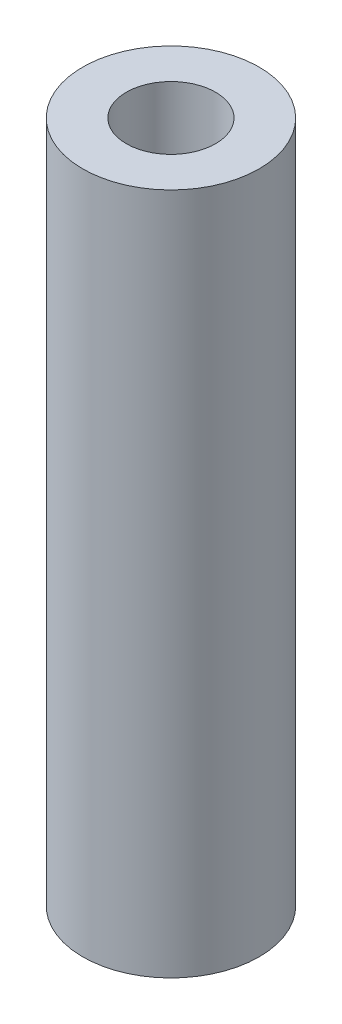
ISO-10303-21;
HEADER;
FILE_DESCRIPTION(('STEP AP214'),'2;1');
FILE_NAME('part.step','',(''),(''),'','','');
FILE_SCHEMA(('AUTOMOTIVE_DESIGN { 1 0 10303 214 1 1 1 1 }'));
ENDSEC;
DATA;
#1=APPLICATION_CONTEXT('core data for automotive mechanical design processes');
#2=APPLICATION_PROTOCOL_DEFINITION('international standard','automotive_design',2000,#1);
#3=PRODUCT_CONTEXT('',#1,'mechanical');
#4=PRODUCT('Part','Part','',(#3));
#5=PRODUCT_RELATED_PRODUCT_CATEGORY('part','',(#4));
#6=PRODUCT_DEFINITION_FORMATION('','',#4);
#7=PRODUCT_DEFINITION_CONTEXT('part definition',#1,'design');
#8=PRODUCT_DEFINITION('design','',#6,#7);
#9=PRODUCT_DEFINITION_SHAPE('','',#8);
#10=(LENGTH_UNIT() NAMED_UNIT(*) SI_UNIT(.MILLI.,.METRE.));
#11=(NAMED_UNIT(*) PLANE_ANGLE_UNIT() SI_UNIT($,.RADIAN.));
#12=(NAMED_UNIT(*) SI_UNIT($,.STERADIAN.) SOLID_ANGLE_UNIT());
#13=UNCERTAINTY_MEASURE_WITH_UNIT(LENGTH_MEASURE(1.E-05),#10,'distance_accuracy_value','');
#14=(GEOMETRIC_REPRESENTATION_CONTEXT(3) GLOBAL_UNCERTAINTY_ASSIGNED_CONTEXT((#13)) GLOBAL_UNIT_ASSIGNED_CONTEXT((#10,
#11,#12)) REPRESENTATION_CONTEXT('',''));
#15=CARTESIAN_POINT('',(0.,0.,0.));
#16=DIRECTION('',(0.,0.,1.));
#17=DIRECTION('',(1.,0.,0.));
#18=AXIS2_PLACEMENT_3D('',#15,#16,#17);
#19=CARTESIAN_POINT('',(0.,94.,0.));
#20=DIRECTION('',(0.,1.,0.));
#21=DIRECTION('',(0.,0.,1.));
#22=AXIS2_PLACEMENT_3D('',#19,#20,#21);
#23=PLANE('',#22);
#24=CARTESIAN_POINT('',(0.,94.,0.));
#25=DIRECTION('',(0.,1.,0.));
#26=DIRECTION('',(1.,0.,0.));
#27=AXIS2_PLACEMENT_3D('',#24,#25,#26);
#28=CIRCLE('',#27,12.15);
#29=CARTESIAN_POINT('',(12.15,94.,0.));
#30=VERTEX_POINT('',#29);
#31=EDGE_CURVE('E11',#30,#30,#28,.T.);
#32=ORIENTED_EDGE('',*,*,#31,.T.);
#33=EDGE_LOOP('',(#32));
#34=FACE_BOUND('',#33,.T.);
#35=CARTESIAN_POINT('',(0.,94.,0.));
#36=DIRECTION('',(0.,1.,0.));
#37=DIRECTION('',(0.,0.,1.));
#38=AXIS2_PLACEMENT_3D('',#35,#36,#37);
#39=CIRCLE('',#38,6.15);
#40=CARTESIAN_POINT('',(0.,94.,6.15));
#41=VERTEX_POINT('',#40);
#42=EDGE_CURVE('E54',#41,#41,#39,.T.);
#43=ORIENTED_EDGE('',*,*,#42,.F.);
#44=EDGE_LOOP('',(#43));
#45=FACE_BOUND('',#44,.T.);
#46=ADVANCED_FACE('F43',(#34,#45),#23,.T.);
#47=CARTESIAN_POINT('',(0.,0.,0.));
#48=DIRECTION('',(0.,1.,0.));
#49=DIRECTION('',(0.,0.,1.));
#50=AXIS2_PLACEMENT_3D('',#47,#48,#49);
#51=PLANE('',#50);
#52=CARTESIAN_POINT('',(0.,0.,0.));
#53=DIRECTION('',(0.,1.,0.));
#54=DIRECTION('',(1.,0.,0.));
#55=AXIS2_PLACEMENT_3D('',#52,#53,#54);
#56=CIRCLE('',#55,12.15);
#57=CARTESIAN_POINT('',(12.15,0.,0.));
#58=VERTEX_POINT('',#57);
#59=EDGE_CURVE('E47',#58,#58,#56,.T.);
#60=ORIENTED_EDGE('',*,*,#59,.F.);
#61=EDGE_LOOP('',(#60));
#62=FACE_BOUND('',#61,.T.);
#63=CARTESIAN_POINT('',(0.,0.,0.));
#64=DIRECTION('',(0.,1.,0.));
#65=DIRECTION('',(0.,0.,1.));
#66=AXIS2_PLACEMENT_3D('',#63,#64,#65);
#67=CIRCLE('',#66,6.15);
#68=CARTESIAN_POINT('',(0.,0.,6.15));
#69=VERTEX_POINT('',#68);
#70=EDGE_CURVE('E56',#69,#69,#67,.T.);
#71=ORIENTED_EDGE('',*,*,#70,.T.);
#72=EDGE_LOOP('',(#71));
#73=FACE_BOUND('',#72,.T.);
#74=ADVANCED_FACE('F66',(#62,#73),#51,.F.);
#75=CARTESIAN_POINT('',(0.,94.,0.));
#76=DIRECTION('',(0.,-1.,0.));
#77=DIRECTION('',(0.,0.,-1.));
#78=AXIS2_PLACEMENT_3D('',#75,#76,#77);
#79=CYLINDRICAL_SURFACE('',#78,12.15);
#80=ORIENTED_EDGE('',*,*,#31,.F.);
#81=EDGE_LOOP('',(#80));
#82=FACE_BOUND('',#81,.T.);
#83=ORIENTED_EDGE('',*,*,#59,.T.);
#84=EDGE_LOOP('',(#83));
#85=FACE_BOUND('',#84,.T.);
#86=ADVANCED_FACE('F45',(#82,#85),#79,.T.);
#87=CARTESIAN_POINT('',(0.,94.,0.));
#88=DIRECTION('',(0.,-1.,0.));
#89=DIRECTION('',(0.,0.,-1.));
#90=AXIS2_PLACEMENT_3D('',#87,#88,#89);
#91=CYLINDRICAL_SURFACE('',#90,6.15);
#92=ORIENTED_EDGE('',*,*,#42,.T.);
#93=EDGE_LOOP('',(#92));
#94=FACE_BOUND('',#93,.T.);
#95=ORIENTED_EDGE('',*,*,#70,.F.);
#96=EDGE_LOOP('',(#95));
#97=FACE_BOUND('',#96,.T.);
#98=ADVANCED_FACE('F62',(#94,#97),#91,.F.);
#99=CLOSED_SHELL('',(#46,#74,#86,#98));
#100=MANIFOLD_SOLID_BREP('B2',#99);
#101=ADVANCED_BREP_SHAPE_REPRESENTATION('',(#18,#100),#14);
#102=SHAPE_DEFINITION_REPRESENTATION(#9,#101);
ENDSEC;
END-ISO-10303-21;
